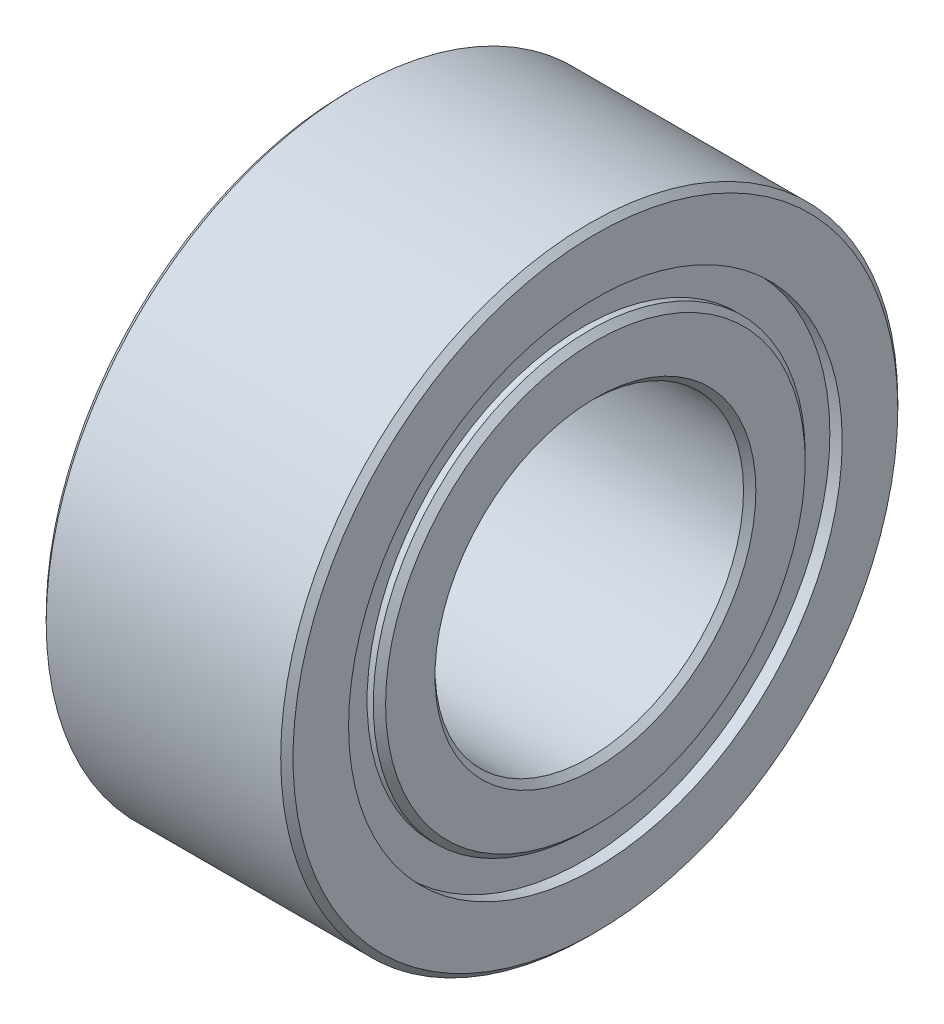
ISO-10303-21;
HEADER;
FILE_DESCRIPTION(('STEP AP214'),'2;1');
FILE_NAME('part.step','',(''),(''),'','','');
FILE_SCHEMA(('AUTOMOTIVE_DESIGN { 1 0 10303 214 1 1 1 1 }'));
ENDSEC;
DATA;
#1=APPLICATION_CONTEXT('core data for automotive mechanical design processes');
#2=APPLICATION_PROTOCOL_DEFINITION('international standard','automotive_design',2000,#1);
#3=PRODUCT_CONTEXT('',#1,'mechanical');
#4=PRODUCT('Part','Part','',(#3));
#5=PRODUCT_RELATED_PRODUCT_CATEGORY('part','',(#4));
#6=PRODUCT_DEFINITION_FORMATION('','',#4);
#7=PRODUCT_DEFINITION_CONTEXT('part definition',#1,'design');
#8=PRODUCT_DEFINITION('design','',#6,#7);
#9=PRODUCT_DEFINITION_SHAPE('','',#8);
#10=(LENGTH_UNIT() NAMED_UNIT(*) SI_UNIT(.MILLI.,.METRE.));
#11=(NAMED_UNIT(*) PLANE_ANGLE_UNIT() SI_UNIT($,.RADIAN.));
#12=(NAMED_UNIT(*) SI_UNIT($,.STERADIAN.) SOLID_ANGLE_UNIT());
#13=UNCERTAINTY_MEASURE_WITH_UNIT(LENGTH_MEASURE(1.E-05),#10,'distance_accuracy_value','');
#14=(GEOMETRIC_REPRESENTATION_CONTEXT(3) GLOBAL_UNCERTAINTY_ASSIGNED_CONTEXT((#13)) GLOBAL_UNIT_ASSIGNED_CONTEXT((#10,
#11,#12)) REPRESENTATION_CONTEXT('',''));
#15=CARTESIAN_POINT('',(0.,0.,0.));
#16=DIRECTION('',(0.,0.,1.));
#17=DIRECTION('',(1.,0.,0.));
#18=AXIS2_PLACEMENT_3D('',#15,#16,#17);
#19=CARTESIAN_POINT('',(0.,0.,0.));
#20=DIRECTION('',(1.,0.,0.));
#21=DIRECTION('',(0.,0.,-1.));
#22=AXIS2_PLACEMENT_3D('',#19,#20,#21);
#23=PLANE('',#22);
#24=CARTESIAN_POINT('',(0.,0.,0.));
#25=DIRECTION('',(1.,0.,0.));
#26=DIRECTION('',(0.,0.,-1.));
#27=AXIS2_PLACEMENT_3D('',#24,#25,#26);
#28=CIRCLE('',#27,2.6);
#29=CARTESIAN_POINT('',(0.,0.,-2.6));
#30=VERTEX_POINT('',#29);
#31=EDGE_CURVE('E42',#30,#30,#28,.T.);
#32=ORIENTED_EDGE('',*,*,#31,.T.);
#33=EDGE_LOOP('',(#32));
#34=FACE_BOUND('',#33,.T.);
#35=CARTESIAN_POINT('',(0.,0.,-0.0491231883012408));
#36=DIRECTION('',(1.,0.,0.));
#37=DIRECTION('',(0.,0.,-1.));
#38=AXIS2_PLACEMENT_3D('',#35,#36,#37);
#39=CIRCLE('',#38,3.4);
#40=CARTESIAN_POINT('',(0.,0.,-3.44912318830124));
#41=VERTEX_POINT('',#40);
#42=EDGE_CURVE('E46',#41,#41,#39,.F.);
#43=ORIENTED_EDGE('',*,*,#42,.T.);
#44=EDGE_LOOP('',(#43));
#45=FACE_BOUND('',#44,.T.);
#46=ADVANCED_FACE('F35',(#34,#45),#23,.F.);
#47=CARTESIAN_POINT('',(4.,0.,0.));
#48=DIRECTION('',(1.,0.,0.));
#49=DIRECTION('',(0.,0.,-1.));
#50=AXIS2_PLACEMENT_3D('',#47,#48,#49);
#51=PLANE('',#50);
#52=CARTESIAN_POINT('',(4.,0.,0.));
#53=DIRECTION('',(1.,0.,0.));
#54=DIRECTION('',(0.,0.,-1.));
#55=AXIS2_PLACEMENT_3D('',#52,#53,#54);
#56=CIRCLE('',#55,2.6);
#57=CARTESIAN_POINT('',(4.,0.,-2.6));
#58=VERTEX_POINT('',#57);
#59=EDGE_CURVE('E64',#58,#58,#56,.F.);
#60=ORIENTED_EDGE('',*,*,#59,.T.);
#61=EDGE_LOOP('',(#60));
#62=FACE_BOUND('',#61,.T.);
#63=CARTESIAN_POINT('',(4.,0.,0.000375624504543939));
#64=DIRECTION('',(1.,0.,0.));
#65=DIRECTION('',(0.,0.,-1.));
#66=AXIS2_PLACEMENT_3D('',#63,#64,#65);
#67=CIRCLE('',#66,3.4);
#68=CARTESIAN_POINT('',(4.,0.,-3.39962437549546));
#69=VERTEX_POINT('',#68);
#70=EDGE_CURVE('E67',#69,#69,#67,.T.);
#71=ORIENTED_EDGE('',*,*,#70,.T.);
#72=EDGE_LOOP('',(#71));
#73=FACE_BOUND('',#72,.T.);
#74=ADVANCED_FACE('F121',(#62,#73),#51,.T.);
#75=CARTESIAN_POINT('',(4.,0.,0.));
#76=DIRECTION('',(1.,0.,0.));
#77=DIRECTION('',(0.,0.,-1.));
#78=AXIS2_PLACEMENT_3D('',#75,#76,#77);
#79=CIRCLE('',#78,4.9);
#80=CARTESIAN_POINT('',(4.,0.,-4.9));
#81=VERTEX_POINT('',#80);
#82=EDGE_CURVE('E82',#81,#81,#79,.T.);
#83=ORIENTED_EDGE('',*,*,#82,.T.);
#84=EDGE_LOOP('',(#83));
#85=FACE_BOUND('',#84,.T.);
#86=CARTESIAN_POINT('',(4.,0.,0.000375624504543939));
#87=DIRECTION('',(1.,0.,0.));
#88=DIRECTION('',(0.,0.,-1.));
#89=AXIS2_PLACEMENT_3D('',#86,#87,#88);
#90=CIRCLE('',#89,3.99962437549546);
#91=CARTESIAN_POINT('',(4.,0.,-3.99924875099091));
#92=VERTEX_POINT('',#91);
#93=EDGE_CURVE('E86',#92,#92,#90,.T.);
#94=ORIENTED_EDGE('',*,*,#93,.F.);
#95=EDGE_LOOP('',(#94));
#96=FACE_BOUND('',#95,.T.);
#97=ADVANCED_FACE('F127',(#85,#96),#51,.T.);
#98=CARTESIAN_POINT('',(0.,0.,0.));
#99=DIRECTION('',(1.,0.,0.));
#100=DIRECTION('',(0.,0.,-1.));
#101=AXIS2_PLACEMENT_3D('',#98,#99,#100);
#102=CIRCLE('',#101,4.9);
#103=CARTESIAN_POINT('',(0.,0.,-4.9));
#104=VERTEX_POINT('',#103);
#105=EDGE_CURVE('E55',#104,#104,#102,.F.);
#106=ORIENTED_EDGE('',*,*,#105,.T.);
#107=EDGE_LOOP('',(#106));
#108=FACE_BOUND('',#107,.T.);
#109=CARTESIAN_POINT('',(0.,0.,-0.0491231883012408));
#110=DIRECTION('',(1.,0.,0.));
#111=DIRECTION('',(0.,0.,-1.));
#112=AXIS2_PLACEMENT_3D('',#109,#110,#111);
#113=CIRCLE('',#112,4.05087681169876);
#114=CARTESIAN_POINT('',(0.,0.,-4.1));
#115=VERTEX_POINT('',#114);
#116=EDGE_CURVE('E58',#115,#115,#113,.T.);
#117=ORIENTED_EDGE('',*,*,#116,.T.);
#118=EDGE_LOOP('',(#117));
#119=FACE_BOUND('',#118,.T.);
#120=ADVANCED_FACE('F123',(#108,#119),#23,.F.);
#121=CARTESIAN_POINT('',(4.,0.,0.));
#122=DIRECTION('',(-1.,0.,0.));
#123=DIRECTION('',(0.,0.,1.));
#124=AXIS2_PLACEMENT_3D('',#121,#122,#123);
#125=CYLINDRICAL_SURFACE('',#124,5.);
#126=CARTESIAN_POINT('',(3.9,0.,0.));
#127=DIRECTION('',(1.,0.,0.));
#128=DIRECTION('',(0.,0.,-1.));
#129=AXIS2_PLACEMENT_3D('',#126,#127,#128);
#130=CIRCLE('',#129,5.);
#131=CARTESIAN_POINT('',(3.9,0.,-5.));
#132=VERTEX_POINT('',#131);
#133=EDGE_CURVE('E76',#132,#132,#130,.F.);
#134=ORIENTED_EDGE('',*,*,#133,.T.);
#135=EDGE_LOOP('',(#134));
#136=FACE_BOUND('',#135,.T.);
#137=CARTESIAN_POINT('',(0.100000000000001,0.,0.));
#138=DIRECTION('',(1.,0.,0.));
#139=DIRECTION('',(0.,0.,-1.));
#140=AXIS2_PLACEMENT_3D('',#137,#138,#139);
#141=CIRCLE('',#140,5.);
#142=CARTESIAN_POINT('',(0.100000000000001,0.,-5.));
#143=VERTEX_POINT('',#142);
#144=EDGE_CURVE('E79',#143,#143,#141,.T.);
#145=ORIENTED_EDGE('',*,*,#144,.T.);
#146=EDGE_LOOP('',(#145));
#147=FACE_BOUND('',#146,.T.);
#148=ADVANCED_FACE('F133',(#136,#147),#125,.T.);
#149=CARTESIAN_POINT('',(4.,0.,0.));
#150=DIRECTION('',(-1.,0.,0.));
#151=DIRECTION('',(0.,0.,1.));
#152=AXIS2_PLACEMENT_3D('',#149,#150,#151);
#153=CYLINDRICAL_SURFACE('',#152,2.5);
#154=CARTESIAN_POINT('',(3.9,0.,0.));
#155=DIRECTION('',(1.,0.,0.));
#156=DIRECTION('',(0.,0.,-1.));
#157=AXIS2_PLACEMENT_3D('',#154,#155,#156);
#158=CIRCLE('',#157,2.5);
#159=CARTESIAN_POINT('',(3.9,0.,-2.5));
#160=VERTEX_POINT('',#159);
#161=EDGE_CURVE('E70',#160,#160,#158,.T.);
#162=ORIENTED_EDGE('',*,*,#161,.T.);
#163=EDGE_LOOP('',(#162));
#164=FACE_BOUND('',#163,.T.);
#165=CARTESIAN_POINT('',(0.0999999999999985,0.,0.));
#166=DIRECTION('',(1.,0.,0.));
#167=DIRECTION('',(0.,0.,-1.));
#168=AXIS2_PLACEMENT_3D('',#165,#166,#167);
#169=CIRCLE('',#168,2.5);
#170=CARTESIAN_POINT('',(0.0999999999999985,0.,-2.5));
#171=VERTEX_POINT('',#170);
#172=EDGE_CURVE('E73',#171,#171,#169,.F.);
#173=ORIENTED_EDGE('',*,*,#172,.T.);
#174=EDGE_LOOP('',(#173));
#175=FACE_BOUND('',#174,.T.);
#176=ADVANCED_FACE('F139',(#164,#175),#153,.F.);
#177=CARTESIAN_POINT('',(3.8,0.,0.000375624504543939));
#178=DIRECTION('',(1.,0.,0.));
#179=DIRECTION('',(0.,0.,-1.));
#180=AXIS2_PLACEMENT_3D('',#177,#178,#179);
#181=CYLINDRICAL_SURFACE('',#180,3.99962437549546);
#182=CARTESIAN_POINT('',(3.8,0.,0.000375624504543939));
#183=DIRECTION('',(1.,0.,0.));
#184=DIRECTION('',(0.,0.,-1.));
#185=AXIS2_PLACEMENT_3D('',#182,#183,#184);
#186=CIRCLE('',#185,3.99962437549546);
#187=CARTESIAN_POINT('',(3.8,0.,-3.99924875099091));
#188=VERTEX_POINT('',#187);
#189=EDGE_CURVE('E85',#188,#188,#186,.T.);
#190=ORIENTED_EDGE('',*,*,#189,.F.);
#191=EDGE_LOOP('',(#190));
#192=FACE_BOUND('',#191,.T.);
#193=ORIENTED_EDGE('',*,*,#93,.T.);
#194=EDGE_LOOP('',(#193));
#195=FACE_BOUND('',#194,.T.);
#196=ADVANCED_FACE('F182',(#192,#195),#181,.F.);
#197=CARTESIAN_POINT('',(3.8,0.,0.000375624504543939));
#198=DIRECTION('',(1.,0.,0.));
#199=DIRECTION('',(0.,0.,-1.));
#200=AXIS2_PLACEMENT_3D('',#197,#198,#199);
#201=PLANE('',#200);
#202=CARTESIAN_POINT('',(3.8,0.,0.000375624504543939));
#203=DIRECTION('',(1.,0.,0.));
#204=DIRECTION('',(0.,0.,-1.));
#205=AXIS2_PLACEMENT_3D('',#202,#203,#204);
#206=CIRCLE('',#205,3.5);
#207=CARTESIAN_POINT('',(3.8,0.,-3.49962437549546));
#208=VERTEX_POINT('',#207);
#209=EDGE_CURVE('E89',#208,#208,#206,.T.);
#210=ORIENTED_EDGE('',*,*,#209,.F.);
#211=EDGE_LOOP('',(#210));
#212=FACE_BOUND('',#211,.T.);
#213=ORIENTED_EDGE('',*,*,#189,.T.);
#214=EDGE_LOOP('',(#213));
#215=FACE_BOUND('',#214,.T.);
#216=ADVANCED_FACE('F117',(#212,#215),#201,.T.);
#217=CARTESIAN_POINT('',(3.8,0.,0.000375624504543939));
#218=DIRECTION('',(1.,0.,0.));
#219=DIRECTION('',(0.,0.,-1.));
#220=AXIS2_PLACEMENT_3D('',#217,#218,#219);
#221=CYLINDRICAL_SURFACE('',#220,3.5);
#222=CARTESIAN_POINT('',(3.9,0.,0.000375624504543939));
#223=DIRECTION('',(1.,0.,0.));
#224=DIRECTION('',(0.,0.,-1.));
#225=AXIS2_PLACEMENT_3D('',#222,#223,#224);
#226=CIRCLE('',#225,3.5);
#227=CARTESIAN_POINT('',(3.9,0.,-3.49962437549546));
#228=VERTEX_POINT('',#227);
#229=EDGE_CURVE('E61',#228,#228,#226,.F.);
#230=ORIENTED_EDGE('',*,*,#229,.T.);
#231=EDGE_LOOP('',(#230));
#232=FACE_BOUND('',#231,.T.);
#233=ORIENTED_EDGE('',*,*,#209,.T.);
#234=EDGE_LOOP('',(#233));
#235=FACE_BOUND('',#234,.T.);
#236=ADVANCED_FACE('F111',(#232,#235),#221,.T.);
#237=CARTESIAN_POINT('',(0.2,0.,-0.0491231883012408));
#238=DIRECTION('',(-1.,0.,0.));
#239=DIRECTION('',(0.,0.,1.));
#240=AXIS2_PLACEMENT_3D('',#237,#238,#239);
#241=CYLINDRICAL_SURFACE('',#240,3.95087681169876);
#242=CARTESIAN_POINT('',(0.0999999999999977,0.,-0.0491231883012408));
#243=DIRECTION('',(1.,0.,0.));
#244=DIRECTION('',(0.,0.,-1.));
#245=AXIS2_PLACEMENT_3D('',#242,#243,#244);
#246=CIRCLE('',#245,3.95087681169876);
#247=CARTESIAN_POINT('',(0.0999999999999977,0.,-4.));
#248=VERTEX_POINT('',#247);
#249=EDGE_CURVE('E50',#248,#248,#246,.F.);
#250=ORIENTED_EDGE('',*,*,#249,.T.);
#251=EDGE_LOOP('',(#250));
#252=FACE_BOUND('',#251,.T.);
#253=CARTESIAN_POINT('',(0.2,0.,-0.0491231883012408));
#254=DIRECTION('',(-1.,0.,0.));
#255=DIRECTION('',(0.,0.,1.));
#256=AXIS2_PLACEMENT_3D('',#253,#254,#255);
#257=CIRCLE('',#256,3.95087681169876);
#258=CARTESIAN_POINT('',(0.2,0.,3.90175362339752));
#259=VERTEX_POINT('',#258);
#260=EDGE_CURVE('E94',#259,#259,#257,.T.);
#261=ORIENTED_EDGE('',*,*,#260,.F.);
#262=EDGE_LOOP('',(#261));
#263=FACE_BOUND('',#262,.T.);
#264=ADVANCED_FACE('F106',(#252,#263),#241,.F.);
#265=CARTESIAN_POINT('',(0.2,0.,-0.0491231883012408));
#266=DIRECTION('',(-1.,0.,0.));
#267=DIRECTION('',(0.,0.,1.));
#268=AXIS2_PLACEMENT_3D('',#265,#266,#267);
#269=PLANE('',#268);
#270=CARTESIAN_POINT('',(0.2,0.,-0.0491231883012408));
#271=DIRECTION('',(-1.,0.,0.));
#272=DIRECTION('',(0.,0.,1.));
#273=AXIS2_PLACEMENT_3D('',#270,#271,#272);
#274=CIRCLE('',#273,3.5);
#275=CARTESIAN_POINT('',(0.2,0.,3.45087681169876));
#276=VERTEX_POINT('',#275);
#277=EDGE_CURVE('E97',#276,#276,#274,.T.);
#278=ORIENTED_EDGE('',*,*,#277,.F.);
#279=EDGE_LOOP('',(#278));
#280=FACE_BOUND('',#279,.T.);
#281=ORIENTED_EDGE('',*,*,#260,.T.);
#282=EDGE_LOOP('',(#281));
#283=FACE_BOUND('',#282,.T.);
#284=ADVANCED_FACE('F103',(#280,#283),#269,.T.);
#285=CARTESIAN_POINT('',(0.2,0.,-0.0491231883012408));
#286=DIRECTION('',(-1.,0.,0.));
#287=DIRECTION('',(0.,0.,1.));
#288=AXIS2_PLACEMENT_3D('',#285,#286,#287);
#289=CYLINDRICAL_SURFACE('',#288,3.5);
#290=CARTESIAN_POINT('',(0.0999999999999976,0.,-0.0491231883012408));
#291=DIRECTION('',(1.,0.,0.));
#292=DIRECTION('',(0.,0.,-1.));
#293=AXIS2_PLACEMENT_3D('',#290,#291,#292);
#294=CIRCLE('',#293,3.5);
#295=CARTESIAN_POINT('',(0.0999999999999976,0.,-3.54912318830124));
#296=VERTEX_POINT('',#295);
#297=EDGE_CURVE('E10',#296,#296,#294,.T.);
#298=ORIENTED_EDGE('',*,*,#297,.T.);
#299=EDGE_LOOP('',(#298));
#300=FACE_BOUND('',#299,.T.);
#301=ORIENTED_EDGE('',*,*,#277,.T.);
#302=EDGE_LOOP('',(#301));
#303=FACE_BOUND('',#302,.T.);
#304=ADVANCED_FACE('F101',(#300,#303),#289,.T.);
#305=CARTESIAN_POINT('',(4.,0.,0.));
#306=DIRECTION('',(-1.,0.,0.));
#307=DIRECTION('',(0.,0.,1.));
#308=AXIS2_PLACEMENT_3D('',#305,#306,#307);
#309=CONICAL_SURFACE('',#308,4.9,0.785398163397448);
#310=ORIENTED_EDGE('',*,*,#133,.F.);
#311=EDGE_LOOP('',(#310));
#312=FACE_BOUND('',#311,.T.);
#313=ORIENTED_EDGE('',*,*,#82,.F.);
#314=EDGE_LOOP('',(#313));
#315=FACE_BOUND('',#314,.T.);
#316=ADVANCED_FACE('F168',(#312,#315),#309,.T.);
#317=CARTESIAN_POINT('',(3.9,0.,0.));
#318=DIRECTION('',(1.,0.,0.));
#319=DIRECTION('',(0.,0.,-1.));
#320=AXIS2_PLACEMENT_3D('',#317,#318,#319);
#321=CONICAL_SURFACE('',#320,2.5,0.785398163397448);
#322=ORIENTED_EDGE('',*,*,#59,.F.);
#323=EDGE_LOOP('',(#322));
#324=FACE_BOUND('',#323,.T.);
#325=ORIENTED_EDGE('',*,*,#161,.F.);
#326=EDGE_LOOP('',(#325));
#327=FACE_BOUND('',#326,.T.);
#328=ADVANCED_FACE('F164',(#324,#327),#321,.F.);
#329=CARTESIAN_POINT('',(4.,0.,0.000375624504543939));
#330=DIRECTION('',(-1.,0.,0.));
#331=DIRECTION('',(0.,0.,1.));
#332=AXIS2_PLACEMENT_3D('',#329,#330,#331);
#333=CONICAL_SURFACE('',#332,3.4,0.78539816339745);
#334=ORIENTED_EDGE('',*,*,#229,.F.);
#335=EDGE_LOOP('',(#334));
#336=FACE_BOUND('',#335,.T.);
#337=ORIENTED_EDGE('',*,*,#70,.F.);
#338=EDGE_LOOP('',(#337));
#339=FACE_BOUND('',#338,.T.);
#340=ADVANCED_FACE('F158',(#336,#339),#333,.T.);
#341=CARTESIAN_POINT('',(0.100000000000001,0.,0.));
#342=DIRECTION('',(1.,0.,0.));
#343=DIRECTION('',(0.,0.,-1.));
#344=AXIS2_PLACEMENT_3D('',#341,#342,#343);
#345=CONICAL_SURFACE('',#344,5.,0.785398163397444);
#346=ORIENTED_EDGE('',*,*,#105,.F.);
#347=EDGE_LOOP('',(#346));
#348=FACE_BOUND('',#347,.T.);
#349=ORIENTED_EDGE('',*,*,#144,.F.);
#350=EDGE_LOOP('',(#349));
#351=FACE_BOUND('',#350,.T.);
#352=ADVANCED_FACE('F150',(#348,#351),#345,.T.);
#353=CARTESIAN_POINT('',(0.0999999999999977,0.,-0.0491231883012408));
#354=DIRECTION('',(-1.,0.,0.));
#355=DIRECTION('',(0.,0.,1.));
#356=AXIS2_PLACEMENT_3D('',#353,#354,#355);
#357=CONICAL_SURFACE('',#356,3.95087681169876,0.785398163397448);
#358=ORIENTED_EDGE('',*,*,#116,.F.);
#359=EDGE_LOOP('',(#358));
#360=FACE_BOUND('',#359,.T.);
#361=ORIENTED_EDGE('',*,*,#249,.F.);
#362=EDGE_LOOP('',(#361));
#363=FACE_BOUND('',#362,.T.);
#364=ADVANCED_FACE('F146',(#360,#363),#357,.F.);
#365=CARTESIAN_POINT('',(0.,0.,0.));
#366=DIRECTION('',(-1.,0.,0.));
#367=DIRECTION('',(0.,0.,1.));
#368=AXIS2_PLACEMENT_3D('',#365,#366,#367);
#369=CONICAL_SURFACE('',#368,2.6,0.785398163397455);
#370=ORIENTED_EDGE('',*,*,#172,.F.);
#371=EDGE_LOOP('',(#370));
#372=FACE_BOUND('',#371,.T.);
#373=ORIENTED_EDGE('',*,*,#31,.F.);
#374=EDGE_LOOP('',(#373));
#375=FACE_BOUND('',#374,.T.);
#376=ADVANCED_FACE('F149',(#372,#375),#369,.F.);
#377=CARTESIAN_POINT('',(0.,0.,-0.0491231883012408));
#378=DIRECTION('',(1.,0.,0.));
#379=DIRECTION('',(0.,0.,-1.));
#380=AXIS2_PLACEMENT_3D('',#377,#378,#379);
#381=CONICAL_SURFACE('',#380,3.4,0.78539816339745);
#382=ORIENTED_EDGE('',*,*,#297,.F.);
#383=EDGE_LOOP('',(#382));
#384=FACE_BOUND('',#383,.T.);
#385=ORIENTED_EDGE('',*,*,#42,.F.);
#386=EDGE_LOOP('',(#385));
#387=FACE_BOUND('',#386,.T.);
#388=ADVANCED_FACE('F37',(#384,#387),#381,.T.);
#389=CLOSED_SHELL('',(#46,#74,#97,#120,#148,#176,#196,#216,#236,#264,#284,#304,#316,#328,#340,
#352,#364,#376,#388));
#390=MANIFOLD_SOLID_BREP('B2',#389);
#391=ADVANCED_BREP_SHAPE_REPRESENTATION('',(#18,#390),#14);
#392=SHAPE_DEFINITION_REPRESENTATION(#9,#391);
ENDSEC;
END-ISO-10303-21;
